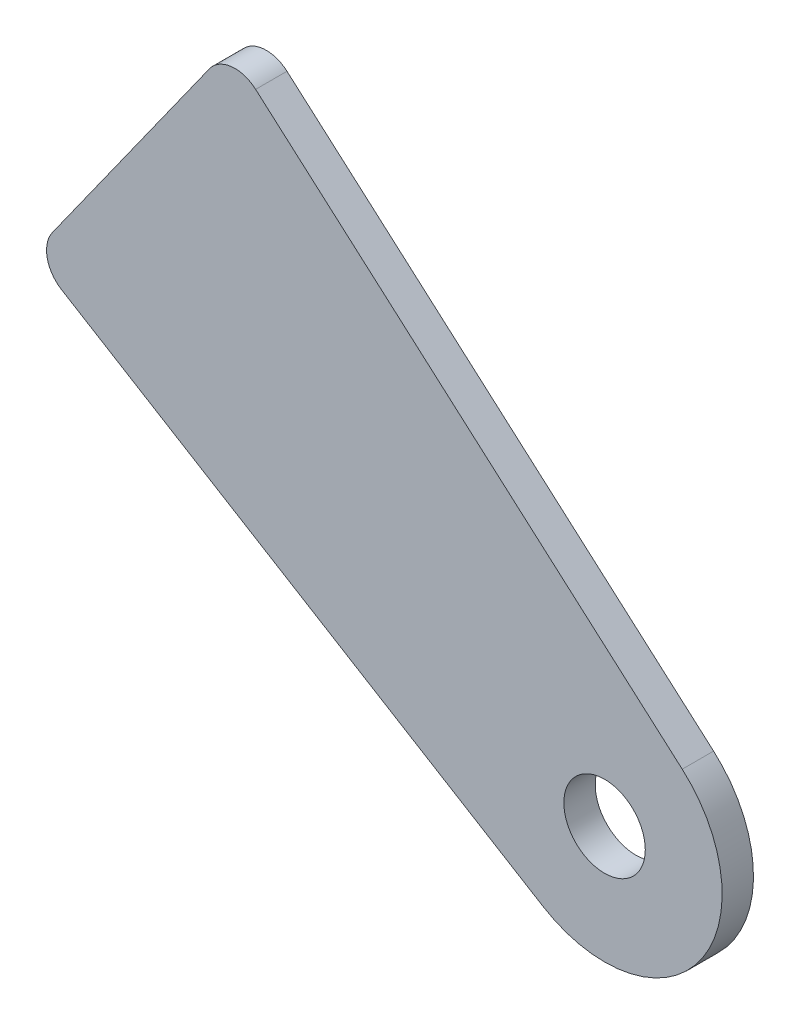
ISO-10303-21;
HEADER;
FILE_DESCRIPTION(('STEP AP214'),'2;1');
FILE_NAME('part.step','',(''),(''),'','','');
FILE_SCHEMA(('AUTOMOTIVE_DESIGN { 1 0 10303 214 1 1 1 1 }'));
ENDSEC;
DATA;
#1=APPLICATION_CONTEXT('core data for automotive mechanical design processes');
#2=APPLICATION_PROTOCOL_DEFINITION('international standard','automotive_design',2000,#1);
#3=PRODUCT_CONTEXT('',#1,'mechanical');
#4=PRODUCT('Part','Part','',(#3));
#5=PRODUCT_RELATED_PRODUCT_CATEGORY('part','',(#4));
#6=PRODUCT_DEFINITION_FORMATION('','',#4);
#7=PRODUCT_DEFINITION_CONTEXT('part definition',#1,'design');
#8=PRODUCT_DEFINITION('design','',#6,#7);
#9=PRODUCT_DEFINITION_SHAPE('','',#8);
#10=(LENGTH_UNIT() NAMED_UNIT(*) SI_UNIT(.MILLI.,.METRE.));
#11=(NAMED_UNIT(*) PLANE_ANGLE_UNIT() SI_UNIT($,.RADIAN.));
#12=(NAMED_UNIT(*) SI_UNIT($,.STERADIAN.) SOLID_ANGLE_UNIT());
#13=UNCERTAINTY_MEASURE_WITH_UNIT(LENGTH_MEASURE(1.E-05),#10,'distance_accuracy_value','');
#14=(GEOMETRIC_REPRESENTATION_CONTEXT(3) GLOBAL_UNCERTAINTY_ASSIGNED_CONTEXT((#13)) GLOBAL_UNIT_ASSIGNED_CONTEXT((#10,
#11,#12)) REPRESENTATION_CONTEXT('',''));
#15=CARTESIAN_POINT('',(0.,0.,0.));
#16=DIRECTION('',(0.,0.,1.));
#17=DIRECTION('',(1.,0.,0.));
#18=AXIS2_PLACEMENT_3D('',#15,#16,#17);
#19=CARTESIAN_POINT('',(37.1462778391526,-27.1478828800577,2.54));
#20=DIRECTION('',(0.,0.,-1.));
#21=DIRECTION('',(-1.,0.,0.));
#22=AXIS2_PLACEMENT_3D('',#19,#20,#21);
#23=PLANE('',#22);
#24=DIRECTION('',(-0.750672826400325,0.660674131250912,0.));
#25=VECTOR('',#24,1.);
#26=CARTESIAN_POINT('',(43.4391989393176,-19.9977242085946,2.54));
#27=LINE('',#26,#25);
#28=CARTESIAN_POINT('',(43.4391989393176,-19.9977242085946,2.54));
#29=VERTEX_POINT('',#28);
#30=CARTESIAN_POINT('',(8.877725708889,10.420149595043,2.54));
#31=VERTEX_POINT('',#30);
#32=EDGE_CURVE('E84',#29,#31,#27,.T.);
#33=ORIENTED_EDGE('',*,*,#32,.T.);
#34=CARTESIAN_POINT('',(7.1996134155117,8.5134406159862,2.54));
#35=DIRECTION('',(0.,0.,-1.));
#36=DIRECTION('',(-1.,0.,0.));
#37=AXIS2_PLACEMENT_3D('',#34,#35,#36);
#38=CIRCLE('',#37,2.54);
#39=CARTESIAN_POINT('',(5.13129413766787,9.98777279188809,2.54));
#40=VERTEX_POINT('',#39);
#41=EDGE_CURVE('E11',#31,#40,#38,.F.);
#42=ORIENTED_EDGE('',*,*,#41,.T.);
#43=DIRECTION('',(-0.580445738544051,-0.81429892828497,0.));
#44=VECTOR('',#43,1.);
#45=CARTESIAN_POINT('',(-9.17325602815749,-10.0798736669311,2.54));
#46=LINE('',#45,#44);
#47=CARTESIAN_POINT('',(-7.58866565264439,-7.85687475614989,2.54));
#48=VERTEX_POINT('',#47);
#49=EDGE_CURVE('E92',#40,#48,#46,.T.);
#50=ORIENTED_EDGE('',*,*,#49,.T.);
#51=CARTESIAN_POINT('',(-5.52034637480057,-9.33120693205177,2.54));
#52=DIRECTION('',(0.,0.,-1.));
#53=DIRECTION('',(-1.,0.,0.));
#54=AXIS2_PLACEMENT_3D('',#51,#52,#53);
#55=CIRCLE('',#54,2.54);
#56=CARTESIAN_POINT('',(-6.84194176870886,-11.500304812462,2.54));
#57=VERTEX_POINT('',#56);
#58=EDGE_CURVE('E121',#48,#57,#55,.F.);
#59=ORIENTED_EDGE('',*,*,#58,.T.);
#60=DIRECTION('',(0.853975543468616,-0.520313147207989,0.));
#61=VECTOR('',#60,1.);
#62=CARTESIAN_POINT('',(32.1902951119966,-35.2819999315963,2.54));
#63=LINE('',#62,#61);
#64=CARTESIAN_POINT('',(32.1902951119966,-35.2819999315963,2.54));
#65=VERTEX_POINT('',#64);
#66=EDGE_CURVE('E98',#57,#65,#63,.T.);
#67=ORIENTED_EDGE('',*,*,#66,.T.);
#68=CARTESIAN_POINT('',(37.1462778391526,-27.1478828800577,2.54));
#69=DIRECTION('',(0.,0.,1.));
#70=DIRECTION('',(-1.,0.,0.));
#71=AXIS2_PLACEMENT_3D('',#68,#69,#70);
#72=CIRCLE('',#71,9.525);
#73=EDGE_CURVE('E93',#65,#29,#72,.T.);
#74=ORIENTED_EDGE('',*,*,#73,.T.);
#75=EDGE_LOOP('',(#33,#42,#50,#59,#67,#74));
#76=FACE_BOUND('',#75,.T.);
#77=CARTESIAN_POINT('',(37.1462778391526,-27.1478828800577,2.54));
#78=DIRECTION('',(0.,0.,1.));
#79=DIRECTION('',(1.,0.,0.));
#80=AXIS2_PLACEMENT_3D('',#77,#78,#79);
#81=CIRCLE('',#80,3.29999999999998);
#82=CARTESIAN_POINT('',(40.4462778391526,-27.1478828800577,2.54));
#83=VERTEX_POINT('',#82);
#84=EDGE_CURVE('E141',#83,#83,#81,.T.);
#85=ORIENTED_EDGE('',*,*,#84,.F.);
#86=EDGE_LOOP('',(#85));
#87=FACE_BOUND('',#86,.T.);
#88=ADVANCED_FACE('F35',(#76,#87),#23,.F.);
#89=CARTESIAN_POINT('',(37.1462778391526,-27.1478828800577,0.));
#90=DIRECTION('',(0.,0.,-1.));
#91=DIRECTION('',(-1.,0.,0.));
#92=AXIS2_PLACEMENT_3D('',#89,#90,#91);
#93=PLANE('',#92);
#94=DIRECTION('',(-0.580445738544051,-0.81429892828497,0.));
#95=VECTOR('',#94,1.);
#96=CARTESIAN_POINT('',(-9.17325602815749,-10.0798736669311,0.));
#97=LINE('',#96,#95);
#98=CARTESIAN_POINT('',(5.13129413766787,9.98777279188809,0.));
#99=VERTEX_POINT('',#98);
#100=CARTESIAN_POINT('',(-7.58866565264439,-7.85687475614989,0.));
#101=VERTEX_POINT('',#100);
#102=EDGE_CURVE('E130',#99,#101,#97,.T.);
#103=ORIENTED_EDGE('',*,*,#102,.F.);
#104=CARTESIAN_POINT('',(7.1996134155117,8.5134406159862,0.));
#105=DIRECTION('',(0.,0.,-1.));
#106=DIRECTION('',(-1.,0.,0.));
#107=AXIS2_PLACEMENT_3D('',#104,#105,#106);
#108=CIRCLE('',#107,2.54);
#109=CARTESIAN_POINT('',(8.877725708889,10.420149595043,0.));
#110=VERTEX_POINT('',#109);
#111=EDGE_CURVE('E57',#99,#110,#108,.T.);
#112=ORIENTED_EDGE('',*,*,#111,.T.);
#113=DIRECTION('',(-0.750672826400325,0.660674131250912,0.));
#114=VECTOR('',#113,1.);
#115=CARTESIAN_POINT('',(43.4391989393176,-19.9977242085946,0.));
#116=LINE('',#115,#114);
#117=CARTESIAN_POINT('',(43.4391989393176,-19.9977242085946,0.));
#118=VERTEX_POINT('',#117);
#119=EDGE_CURVE('E136',#118,#110,#116,.T.);
#120=ORIENTED_EDGE('',*,*,#119,.F.);
#121=CARTESIAN_POINT('',(37.1462778391526,-27.1478828800577,0.));
#122=DIRECTION('',(0.,0.,1.));
#123=DIRECTION('',(-1.,0.,0.));
#124=AXIS2_PLACEMENT_3D('',#121,#122,#123);
#125=CIRCLE('',#124,9.525);
#126=CARTESIAN_POINT('',(32.1902951119966,-35.2819999315963,0.));
#127=VERTEX_POINT('',#126);
#128=EDGE_CURVE('E106',#127,#118,#125,.T.);
#129=ORIENTED_EDGE('',*,*,#128,.F.);
#130=DIRECTION('',(0.853975543468616,-0.520313147207989,0.));
#131=VECTOR('',#130,1.);
#132=CARTESIAN_POINT('',(32.1902951119966,-35.2819999315963,0.));
#133=LINE('',#132,#131);
#134=CARTESIAN_POINT('',(-6.84194176870886,-11.500304812462,0.));
#135=VERTEX_POINT('',#134);
#136=EDGE_CURVE('E102',#135,#127,#133,.T.);
#137=ORIENTED_EDGE('',*,*,#136,.F.);
#138=CARTESIAN_POINT('',(-5.52034637480057,-9.33120693205177,0.));
#139=DIRECTION('',(0.,0.,-1.));
#140=DIRECTION('',(-1.,0.,0.));
#141=AXIS2_PLACEMENT_3D('',#138,#139,#140);
#142=CIRCLE('',#141,2.54);
#143=EDGE_CURVE('E111',#135,#101,#142,.T.);
#144=ORIENTED_EDGE('',*,*,#143,.T.);
#145=EDGE_LOOP('',(#103,#112,#120,#129,#137,#144));
#146=FACE_BOUND('',#145,.T.);
#147=CARTESIAN_POINT('',(37.1462778391526,-27.1478828800577,0.));
#148=DIRECTION('',(0.,0.,1.));
#149=DIRECTION('',(1.,0.,0.));
#150=AXIS2_PLACEMENT_3D('',#147,#148,#149);
#151=CIRCLE('',#150,3.29999999999998);
#152=CARTESIAN_POINT('',(40.4462778391526,-27.1478828800577,0.));
#153=VERTEX_POINT('',#152);
#154=EDGE_CURVE('E144',#153,#153,#151,.T.);
#155=ORIENTED_EDGE('',*,*,#154,.T.);
#156=EDGE_LOOP('',(#155));
#157=FACE_BOUND('',#156,.T.);
#158=ADVANCED_FACE('F132',(#146,#157),#93,.T.);
#159=CARTESIAN_POINT('',(37.1462778391526,-27.1478828800577,2.54));
#160=DIRECTION('',(0.,0.,-1.));
#161=DIRECTION('',(-1.,0.,0.));
#162=AXIS2_PLACEMENT_3D('',#159,#160,#161);
#163=CYLINDRICAL_SURFACE('',#162,9.525);
#164=ORIENTED_EDGE('',*,*,#128,.T.);
#165=DIRECTION('',(0.,0.,-1.));
#166=VECTOR('',#165,1.);
#167=CARTESIAN_POINT('',(43.4391989393176,-19.9977242085946,2.54));
#168=LINE('',#167,#166);
#169=EDGE_CURVE('E88',#29,#118,#168,.T.);
#170=ORIENTED_EDGE('',*,*,#169,.F.);
#171=ORIENTED_EDGE('',*,*,#73,.F.);
#172=DIRECTION('',(0.,0.,-1.));
#173=VECTOR('',#172,1.);
#174=CARTESIAN_POINT('',(32.1902951119966,-35.2819999315963,2.54));
#175=LINE('',#174,#173);
#176=EDGE_CURVE('E108',#65,#127,#175,.T.);
#177=ORIENTED_EDGE('',*,*,#176,.T.);
#178=EDGE_LOOP('',(#164,#170,#171,#177));
#179=FACE_BOUND('',#178,.T.);
#180=ADVANCED_FACE('F104',(#179),#163,.T.);
#181=CARTESIAN_POINT('',(43.4391989393176,-19.9977242085946,2.54));
#182=DIRECTION('',(-0.660674131250912,-0.750672826400325,0.));
#183=DIRECTION('',(0.750672826400325,-0.660674131250912,0.));
#184=AXIS2_PLACEMENT_3D('',#181,#182,#183);
#185=PLANE('',#184);
#186=ORIENTED_EDGE('',*,*,#119,.T.);
#187=DIRECTION('',(0.,0.,-1.));
#188=VECTOR('',#187,1.);
#189=CARTESIAN_POINT('',(8.87772570888902,10.420149595043,2.54));
#190=LINE('',#189,#188);
#191=EDGE_CURVE('E43',#110,#31,#190,.F.);
#192=ORIENTED_EDGE('',*,*,#191,.T.);
#193=ORIENTED_EDGE('',*,*,#32,.F.);
#194=ORIENTED_EDGE('',*,*,#169,.T.);
#195=EDGE_LOOP('',(#186,#192,#193,#194));
#196=FACE_BOUND('',#195,.T.);
#197=ADVANCED_FACE('F86',(#196),#185,.F.);
#198=CARTESIAN_POINT('',(-9.17325602815749,-10.0798736669311,2.54));
#199=DIRECTION('',(0.81429892828497,-0.580445738544051,0.));
#200=DIRECTION('',(0.580445738544051,0.81429892828497,0.));
#201=AXIS2_PLACEMENT_3D('',#198,#199,#200);
#202=PLANE('',#201);
#203=ORIENTED_EDGE('',*,*,#49,.F.);
#204=DIRECTION('',(0.,0.,-1.));
#205=VECTOR('',#204,1.);
#206=CARTESIAN_POINT('',(5.13129413766787,9.98777279188809,2.54));
#207=LINE('',#206,#205);
#208=EDGE_CURVE('E123',#40,#99,#207,.T.);
#209=ORIENTED_EDGE('',*,*,#208,.T.);
#210=ORIENTED_EDGE('',*,*,#102,.T.);
#211=DIRECTION('',(0.,0.,-1.));
#212=VECTOR('',#211,1.);
#213=CARTESIAN_POINT('',(-7.58866565264439,-7.85687475614989,2.54));
#214=LINE('',#213,#212);
#215=EDGE_CURVE('E118',#101,#48,#214,.F.);
#216=ORIENTED_EDGE('',*,*,#215,.T.);
#217=EDGE_LOOP('',(#203,#209,#210,#216));
#218=FACE_BOUND('',#217,.T.);
#219=ADVANCED_FACE('F129',(#218),#202,.F.);
#220=CARTESIAN_POINT('',(32.1902951119966,-35.2819999315963,2.54));
#221=DIRECTION('',(0.520313147207989,0.853975543468616,0.));
#222=DIRECTION('',(-0.853975543468616,0.520313147207989,0.));
#223=AXIS2_PLACEMENT_3D('',#220,#221,#222);
#224=PLANE('',#223);
#225=ORIENTED_EDGE('',*,*,#66,.F.);
#226=DIRECTION('',(0.,0.,-1.));
#227=VECTOR('',#226,1.);
#228=CARTESIAN_POINT('',(-6.84194176870886,-11.500304812462,2.54));
#229=LINE('',#228,#227);
#230=EDGE_CURVE('E107',#57,#135,#229,.T.);
#231=ORIENTED_EDGE('',*,*,#230,.T.);
#232=ORIENTED_EDGE('',*,*,#136,.T.);
#233=ORIENTED_EDGE('',*,*,#176,.F.);
#234=EDGE_LOOP('',(#225,#231,#232,#233));
#235=FACE_BOUND('',#234,.T.);
#236=ADVANCED_FACE('F160',(#235),#224,.F.);
#237=CARTESIAN_POINT('',(37.1462778391526,-27.1478828800577,2.54));
#238=DIRECTION('',(0.,0.,-1.));
#239=DIRECTION('',(-1.,0.,0.));
#240=AXIS2_PLACEMENT_3D('',#237,#238,#239);
#241=CYLINDRICAL_SURFACE('',#240,3.29999999999998);
#242=ORIENTED_EDGE('',*,*,#84,.T.);
#243=EDGE_LOOP('',(#242));
#244=FACE_BOUND('',#243,.T.);
#245=ORIENTED_EDGE('',*,*,#154,.F.);
#246=EDGE_LOOP('',(#245));
#247=FACE_BOUND('',#246,.T.);
#248=ADVANCED_FACE('F150',(#244,#247),#241,.F.);
#249=CARTESIAN_POINT('',(-5.52034637480057,-9.33120693205177,2.54));
#250=DIRECTION('',(0.,0.,-1.));
#251=DIRECTION('',(-1.,0.,0.));
#252=AXIS2_PLACEMENT_3D('',#249,#250,#251);
#253=CYLINDRICAL_SURFACE('',#252,2.54);
#254=ORIENTED_EDGE('',*,*,#58,.F.);
#255=ORIENTED_EDGE('',*,*,#215,.F.);
#256=ORIENTED_EDGE('',*,*,#143,.F.);
#257=ORIENTED_EDGE('',*,*,#230,.F.);
#258=EDGE_LOOP('',(#254,#255,#256,#257));
#259=FACE_BOUND('',#258,.T.);
#260=ADVANCED_FACE('F169',(#259),#253,.T.);
#261=CARTESIAN_POINT('',(7.1996134155117,8.5134406159862,2.54));
#262=DIRECTION('',(0.,0.,-1.));
#263=DIRECTION('',(-1.,0.,0.));
#264=AXIS2_PLACEMENT_3D('',#261,#262,#263);
#265=CYLINDRICAL_SURFACE('',#264,2.54);
#266=ORIENTED_EDGE('',*,*,#41,.F.);
#267=ORIENTED_EDGE('',*,*,#191,.F.);
#268=ORIENTED_EDGE('',*,*,#111,.F.);
#269=ORIENTED_EDGE('',*,*,#208,.F.);
#270=EDGE_LOOP('',(#266,#267,#268,#269));
#271=FACE_BOUND('',#270,.T.);
#272=ADVANCED_FACE('F37',(#271),#265,.T.);
#273=CLOSED_SHELL('',(#88,#158,#180,#197,#219,#236,#248,#260,#272));
#274=MANIFOLD_SOLID_BREP('B2',#273);
#275=ADVANCED_BREP_SHAPE_REPRESENTATION('',(#18,#274),#14);
#276=SHAPE_DEFINITION_REPRESENTATION(#9,#275);
ENDSEC;
END-ISO-10303-21;
